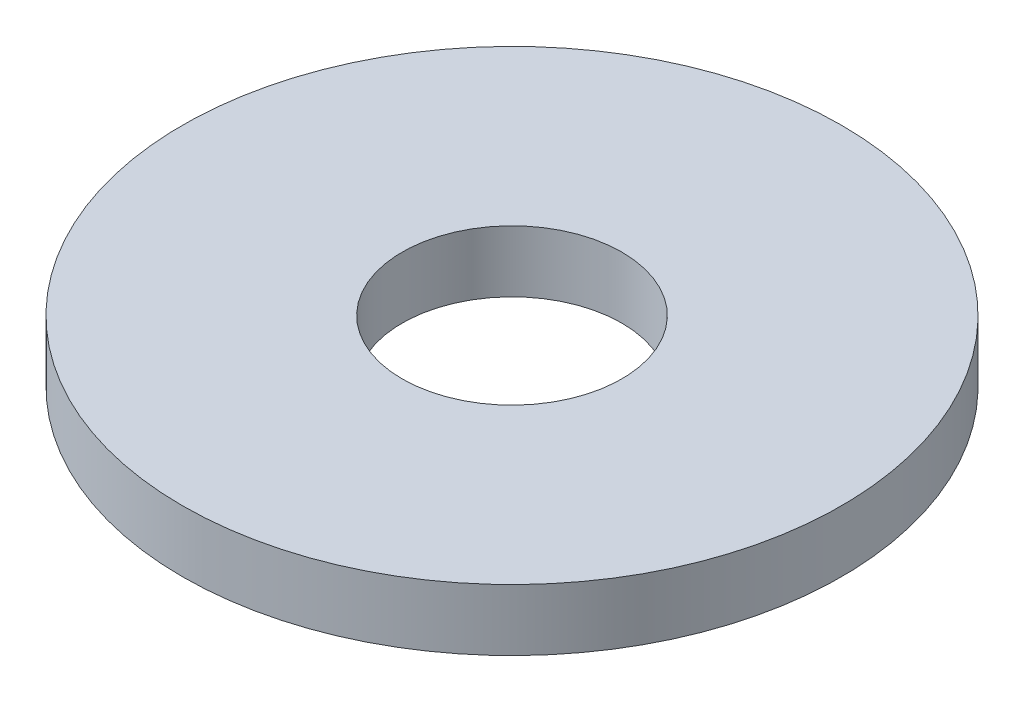
ISO-10303-21;
HEADER;
FILE_DESCRIPTION(('STEP AP214'),'2;1');
FILE_NAME('part.step','',(''),(''),'','','');
FILE_SCHEMA(('AUTOMOTIVE_DESIGN { 1 0 10303 214 1 1 1 1 }'));
ENDSEC;
DATA;
#1=APPLICATION_CONTEXT('core data for automotive mechanical design processes');
#2=APPLICATION_PROTOCOL_DEFINITION('international standard','automotive_design',2000,#1);
#3=PRODUCT_CONTEXT('',#1,'mechanical');
#4=PRODUCT('Part','Part','',(#3));
#5=PRODUCT_RELATED_PRODUCT_CATEGORY('part','',(#4));
#6=PRODUCT_DEFINITION_FORMATION('','',#4);
#7=PRODUCT_DEFINITION_CONTEXT('part definition',#1,'design');
#8=PRODUCT_DEFINITION('design','',#6,#7);
#9=PRODUCT_DEFINITION_SHAPE('','',#8);
#10=(LENGTH_UNIT() NAMED_UNIT(*) SI_UNIT(.MILLI.,.METRE.));
#11=(NAMED_UNIT(*) PLANE_ANGLE_UNIT() SI_UNIT($,.RADIAN.));
#12=(NAMED_UNIT(*) SI_UNIT($,.STERADIAN.) SOLID_ANGLE_UNIT());
#13=UNCERTAINTY_MEASURE_WITH_UNIT(LENGTH_MEASURE(1.E-05),#10,'distance_accuracy_value','');
#14=(GEOMETRIC_REPRESENTATION_CONTEXT(3) GLOBAL_UNCERTAINTY_ASSIGNED_CONTEXT((#13)) GLOBAL_UNIT_ASSIGNED_CONTEXT((#10,
#11,#12)) REPRESENTATION_CONTEXT('',''));
#15=CARTESIAN_POINT('',(0.,0.,0.));
#16=DIRECTION('',(0.,0.,1.));
#17=DIRECTION('',(1.,0.,0.));
#18=AXIS2_PLACEMENT_3D('',#15,#16,#17);
#19=CARTESIAN_POINT('',(0.,14.,0.));
#20=DIRECTION('',(0.,-1.,0.));
#21=DIRECTION('',(0.,0.,-1.));
#22=AXIS2_PLACEMENT_3D('',#19,#20,#21);
#23=CYLINDRICAL_SURFACE('',#22,75.);
#24=CARTESIAN_POINT('',(0.,14.,0.));
#25=DIRECTION('',(0.,1.,0.));
#26=DIRECTION('',(0.,0.,1.));
#27=AXIS2_PLACEMENT_3D('',#24,#25,#26);
#28=CIRCLE('',#27,75.);
#29=CARTESIAN_POINT('',(0.,14.,75.));
#30=VERTEX_POINT('',#29);
#31=EDGE_CURVE('E10',#30,#30,#28,.T.);
#32=ORIENTED_EDGE('',*,*,#31,.F.);
#33=EDGE_LOOP('',(#32));
#34=FACE_BOUND('',#33,.T.);
#35=CARTESIAN_POINT('',(0.,0.,0.));
#36=DIRECTION('',(0.,1.,0.));
#37=DIRECTION('',(0.,0.,1.));
#38=AXIS2_PLACEMENT_3D('',#35,#36,#37);
#39=CIRCLE('',#38,75.);
#40=CARTESIAN_POINT('',(0.,0.,75.));
#41=VERTEX_POINT('',#40);
#42=EDGE_CURVE('E37',#41,#41,#39,.T.);
#43=ORIENTED_EDGE('',*,*,#42,.T.);
#44=EDGE_LOOP('',(#43));
#45=FACE_BOUND('',#44,.T.);
#46=ADVANCED_FACE('F40',(#34,#45),#23,.T.);
#47=CARTESIAN_POINT('',(0.,14.,0.));
#48=DIRECTION('',(0.,1.,0.));
#49=DIRECTION('',(0.,0.,1.));
#50=AXIS2_PLACEMENT_3D('',#47,#48,#49);
#51=PLANE('',#50);
#52=CARTESIAN_POINT('',(0.,14.,0.));
#53=DIRECTION('',(0.,1.,0.));
#54=DIRECTION('',(0.,0.,1.));
#55=AXIS2_PLACEMENT_3D('',#52,#53,#54);
#56=CIRCLE('',#55,25.);
#57=CARTESIAN_POINT('',(0.,14.,25.));
#58=VERTEX_POINT('',#57);
#59=EDGE_CURVE('E50',#58,#58,#56,.T.);
#60=ORIENTED_EDGE('',*,*,#59,.F.);
#61=EDGE_LOOP('',(#60));
#62=FACE_BOUND('',#61,.T.);
#63=ORIENTED_EDGE('',*,*,#31,.T.);
#64=EDGE_LOOP('',(#63));
#65=FACE_BOUND('',#64,.T.);
#66=ADVANCED_FACE('F59',(#62,#65),#51,.T.);
#67=CARTESIAN_POINT('',(0.,0.,0.));
#68=DIRECTION('',(0.,1.,0.));
#69=DIRECTION('',(0.,0.,1.));
#70=AXIS2_PLACEMENT_3D('',#67,#68,#69);
#71=PLANE('',#70);
#72=CARTESIAN_POINT('',(0.,0.,0.));
#73=DIRECTION('',(0.,1.,0.));
#74=DIRECTION('',(0.,0.,1.));
#75=AXIS2_PLACEMENT_3D('',#72,#73,#74);
#76=CIRCLE('',#75,25.);
#77=CARTESIAN_POINT('',(0.,0.,25.));
#78=VERTEX_POINT('',#77);
#79=EDGE_CURVE('E47',#78,#78,#76,.T.);
#80=ORIENTED_EDGE('',*,*,#79,.T.);
#81=EDGE_LOOP('',(#80));
#82=FACE_BOUND('',#81,.T.);
#83=ORIENTED_EDGE('',*,*,#42,.F.);
#84=EDGE_LOOP('',(#83));
#85=FACE_BOUND('',#84,.T.);
#86=ADVANCED_FACE('F58',(#82,#85),#71,.F.);
#87=CARTESIAN_POINT('',(0.,14.,0.));
#88=DIRECTION('',(0.,-1.,0.));
#89=DIRECTION('',(0.,0.,-1.));
#90=AXIS2_PLACEMENT_3D('',#87,#88,#89);
#91=CYLINDRICAL_SURFACE('',#90,25.);
#92=ORIENTED_EDGE('',*,*,#59,.T.);
#93=EDGE_LOOP('',(#92));
#94=FACE_BOUND('',#93,.T.);
#95=ORIENTED_EDGE('',*,*,#79,.F.);
#96=EDGE_LOOP('',(#95));
#97=FACE_BOUND('',#96,.T.);
#98=ADVANCED_FACE('F54',(#94,#97),#91,.F.);
#99=CLOSED_SHELL('',(#46,#66,#86,#98));
#100=MANIFOLD_SOLID_BREP('B2',#99);
#101=ADVANCED_BREP_SHAPE_REPRESENTATION('',(#18,#100),#14);
#102=SHAPE_DEFINITION_REPRESENTATION(#9,#101);
ENDSEC;
END-ISO-10303-21;
